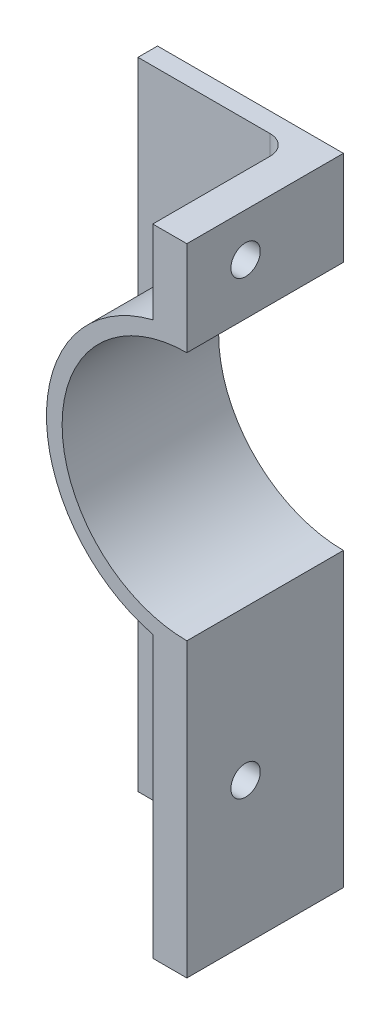
ISO-10303-21;
HEADER;
FILE_DESCRIPTION(('STEP AP214'),'2;1');
FILE_NAME('part.step','',(''),(''),'','','');
FILE_SCHEMA(('AUTOMOTIVE_DESIGN { 1 0 10303 214 1 1 1 1 }'));
ENDSEC;
DATA;
#1=APPLICATION_CONTEXT('core data for automotive mechanical design processes');
#2=APPLICATION_PROTOCOL_DEFINITION('international standard','automotive_design',2000,#1);
#3=PRODUCT_CONTEXT('',#1,'mechanical');
#4=PRODUCT('Part','Part','',(#3));
#5=PRODUCT_RELATED_PRODUCT_CATEGORY('part','',(#4));
#6=PRODUCT_DEFINITION_FORMATION('','',#4);
#7=PRODUCT_DEFINITION_CONTEXT('part definition',#1,'design');
#8=PRODUCT_DEFINITION('design','',#6,#7);
#9=PRODUCT_DEFINITION_SHAPE('','',#8);
#10=(LENGTH_UNIT() NAMED_UNIT(*) SI_UNIT(.MILLI.,.METRE.));
#11=(NAMED_UNIT(*) PLANE_ANGLE_UNIT() SI_UNIT($,.RADIAN.));
#12=(NAMED_UNIT(*) SI_UNIT($,.STERADIAN.) SOLID_ANGLE_UNIT());
#13=UNCERTAINTY_MEASURE_WITH_UNIT(LENGTH_MEASURE(1.E-05),#10,'distance_accuracy_value','');
#14=(GEOMETRIC_REPRESENTATION_CONTEXT(3) GLOBAL_UNCERTAINTY_ASSIGNED_CONTEXT((#13)) GLOBAL_UNIT_ASSIGNED_CONTEXT((#10,
#11,#12)) REPRESENTATION_CONTEXT('',''));
#15=CARTESIAN_POINT('',(0.,0.,0.));
#16=DIRECTION('',(0.,0.,1.));
#17=DIRECTION('',(1.,0.,0.));
#18=AXIS2_PLACEMENT_3D('',#15,#16,#17);
#19=CARTESIAN_POINT('',(19.7022423830163,0.,20.32));
#20=DIRECTION('',(1.,0.,0.));
#21=DIRECTION('',(0.,0.,-1.));
#22=AXIS2_PLACEMENT_3D('',#19,#20,#21);
#23=PLANE('',#22);
#24=CARTESIAN_POINT('',(19.7022423830163,76.9461103821239,12.7));
#25=DIRECTION('',(1.,0.,0.));
#26=DIRECTION('',(0.,0.,-1.));
#27=AXIS2_PLACEMENT_3D('',#24,#25,#26);
#28=CIRCLE('',#27,1.905);
#29=CARTESIAN_POINT('',(19.7022423830163,76.9461103821239,10.795));
#30=VERTEX_POINT('',#29);
#31=EDGE_CURVE('E346',#30,#30,#28,.F.);
#32=ORIENTED_EDGE('',*,*,#31,.F.);
#33=EDGE_LOOP('',(#32));
#34=FACE_BOUND('',#33,.T.);
#35=DIRECTION('',(0.,0.,-1.));
#36=VECTOR('',#35,1.);
#37=CARTESIAN_POINT('',(19.7022423830163,82.55,20.32));
#38=LINE('',#37,#36);
#39=CARTESIAN_POINT('',(19.7022423830163,82.55,20.32));
#40=VERTEX_POINT('',#39);
#41=CARTESIAN_POINT('',(19.7022423830163,82.55,5.08));
#42=VERTEX_POINT('',#41);
#43=EDGE_CURVE('E211',#40,#42,#38,.T.);
#44=ORIENTED_EDGE('',*,*,#43,.T.);
#45=DIRECTION('',(0.,-1.,0.));
#46=VECTOR('',#45,1.);
#47=CARTESIAN_POINT('',(19.7022423830163,0.,5.08));
#48=LINE('',#47,#46);
#49=CARTESIAN_POINT('',(19.7022423830163,71.7804434477485,5.08));
#50=VERTEX_POINT('',#49);
#51=EDGE_CURVE('E249',#42,#50,#48,.T.);
#52=ORIENTED_EDGE('',*,*,#51,.T.);
#53=DIRECTION('',(0.,0.,-1.));
#54=VECTOR('',#53,1.);
#55=CARTESIAN_POINT('',(19.7022423830163,71.7804434477485,20.32));
#56=LINE('',#55,#54);
#57=CARTESIAN_POINT('',(19.7022423830163,71.7804434477485,20.32));
#58=VERTEX_POINT('',#57);
#59=EDGE_CURVE('E246',#58,#50,#56,.T.);
#60=ORIENTED_EDGE('',*,*,#59,.F.);
#61=DIRECTION('',(0.,-1.,0.));
#62=VECTOR('',#61,1.);
#63=CARTESIAN_POINT('',(19.7022423830163,0.,20.32));
#64=LINE('',#63,#62);
#65=EDGE_CURVE('E183',#40,#58,#64,.T.);
#66=ORIENTED_EDGE('',*,*,#65,.F.);
#67=EDGE_LOOP('',(#44,#52,#60,#66));
#68=FACE_BOUND('',#67,.T.);
#69=ADVANCED_FACE('F45',(#34,#68),#23,.F.);
#70=CARTESIAN_POINT('',(24.13,54.102,20.32));
#71=DIRECTION('',(0.,0.,-1.));
#72=DIRECTION('',(-1.,0.,0.));
#73=AXIS2_PLACEMENT_3D('',#70,#71,#72);
#74=CYLINDRICAL_SURFACE('',#73,18.2245);
#75=ORIENTED_EDGE('',*,*,#59,.T.);
#76=CARTESIAN_POINT('',(24.13,54.102,5.08));
#77=DIRECTION('',(0.,0.,1.));
#78=DIRECTION('',(1.,0.,0.));
#79=AXIS2_PLACEMENT_3D('',#76,#77,#78);
#80=CIRCLE('',#79,18.2245);
#81=CARTESIAN_POINT('',(19.7022423830163,36.4235565522515,5.08));
#82=VERTEX_POINT('',#81);
#83=EDGE_CURVE('E76',#50,#82,#80,.T.);
#84=ORIENTED_EDGE('',*,*,#83,.T.);
#85=DIRECTION('',(0.,0.,-1.));
#86=VECTOR('',#85,1.);
#87=CARTESIAN_POINT('',(19.7022423830163,36.4235565522515,20.32));
#88=LINE('',#87,#86);
#89=CARTESIAN_POINT('',(19.7022423830163,36.4235565522515,20.32));
#90=VERTEX_POINT('',#89);
#91=EDGE_CURVE('E243',#90,#82,#88,.T.);
#92=ORIENTED_EDGE('',*,*,#91,.F.);
#93=CARTESIAN_POINT('',(24.13,54.102,20.32));
#94=DIRECTION('',(0.,0.,1.));
#95=DIRECTION('',(1.,0.,0.));
#96=AXIS2_PLACEMENT_3D('',#93,#94,#95);
#97=CIRCLE('',#96,18.2245);
#98=EDGE_CURVE('E187',#58,#90,#97,.T.);
#99=ORIENTED_EDGE('',*,*,#98,.F.);
#100=EDGE_LOOP('',(#75,#84,#92,#99));
#101=FACE_BOUND('',#100,.T.);
#102=ADVANCED_FACE('F290',(#101),#74,.T.);
#103=CARTESIAN_POINT('',(19.7022423830163,0.,20.32));
#104=DIRECTION('',(-1.,0.,0.));
#105=DIRECTION('',(0.,0.,1.));
#106=AXIS2_PLACEMENT_3D('',#103,#104,#105);
#107=PLANE('',#106);
#108=CARTESIAN_POINT('',(19.7022423830163,18.4308896178761,12.7));
#109=DIRECTION('',(-1.,0.,0.));
#110=DIRECTION('',(0.,0.,1.));
#111=AXIS2_PLACEMENT_3D('',#108,#109,#110);
#112=CIRCLE('',#111,1.905);
#113=CARTESIAN_POINT('',(19.7022423830163,18.4308896178761,14.605));
#114=VERTEX_POINT('',#113);
#115=EDGE_CURVE('E180',#114,#114,#112,.F.);
#116=ORIENTED_EDGE('',*,*,#115,.T.);
#117=EDGE_LOOP('',(#116));
#118=FACE_BOUND('',#117,.T.);
#119=ORIENTED_EDGE('',*,*,#91,.T.);
#120=DIRECTION('',(0.,1.,0.));
#121=VECTOR('',#120,1.);
#122=CARTESIAN_POINT('',(19.7022423830163,0.,5.08));
#123=LINE('',#122,#121);
#124=CARTESIAN_POINT('',(19.7022423830163,0.,5.08));
#125=VERTEX_POINT('',#124);
#126=EDGE_CURVE('E68',#82,#125,#123,.F.);
#127=ORIENTED_EDGE('',*,*,#126,.T.);
#128=DIRECTION('',(0.,0.,-1.));
#129=VECTOR('',#128,1.);
#130=CARTESIAN_POINT('',(19.7022423830163,0.,20.32));
#131=LINE('',#130,#129);
#132=CARTESIAN_POINT('',(19.7022423830163,0.,20.32));
#133=VERTEX_POINT('',#132);
#134=EDGE_CURVE('E240',#133,#125,#131,.T.);
#135=ORIENTED_EDGE('',*,*,#134,.F.);
#136=DIRECTION('',(0.,1.,0.));
#137=VECTOR('',#136,1.);
#138=CARTESIAN_POINT('',(19.7022423830163,0.,20.32));
#139=LINE('',#138,#137);
#140=EDGE_CURVE('E190',#133,#90,#139,.T.);
#141=ORIENTED_EDGE('',*,*,#140,.T.);
#142=EDGE_LOOP('',(#119,#127,#135,#141));
#143=FACE_BOUND('',#142,.T.);
#144=ADVANCED_FACE('F295',(#118,#143),#107,.T.);
#145=CARTESIAN_POINT('',(0.,0.,20.32));
#146=DIRECTION('',(0.,-1.,0.));
#147=DIRECTION('',(0.,0.,-1.));
#148=AXIS2_PLACEMENT_3D('',#145,#146,#147);
#149=PLANE('',#148);
#150=DIRECTION('',(-1.,0.,0.));
#151=VECTOR('',#150,1.);
#152=CARTESIAN_POINT('',(0.,0.,0.));
#153=LINE('',#152,#151);
#154=CARTESIAN_POINT('',(24.13,0.,0.));
#155=VERTEX_POINT('',#154);
#156=CARTESIAN_POINT('',(0.,0.,0.));
#157=VERTEX_POINT('',#156);
#158=EDGE_CURVE('E155',#155,#157,#153,.T.);
#159=ORIENTED_EDGE('',*,*,#158,.F.);
#160=DIRECTION('',(0.,0.,-1.));
#161=VECTOR('',#160,1.);
#162=CARTESIAN_POINT('',(24.13,0.,20.32));
#163=LINE('',#162,#161);
#164=CARTESIAN_POINT('',(24.13,0.,20.32));
#165=VERTEX_POINT('',#164);
#166=EDGE_CURVE('E237',#165,#155,#163,.T.);
#167=ORIENTED_EDGE('',*,*,#166,.F.);
#168=DIRECTION('',(-1.,0.,0.));
#169=VECTOR('',#168,1.);
#170=CARTESIAN_POINT('',(0.,0.,20.32));
#171=LINE('',#170,#169);
#172=EDGE_CURVE('E194',#165,#133,#171,.T.);
#173=ORIENTED_EDGE('',*,*,#172,.T.);
#174=ORIENTED_EDGE('',*,*,#134,.T.);
#175=CARTESIAN_POINT('',(17.1622423830163,0.,5.08));
#176=DIRECTION('',(0.,-1.,0.));
#177=DIRECTION('',(0.,0.,-1.));
#178=AXIS2_PLACEMENT_3D('',#175,#176,#177);
#179=CIRCLE('',#178,2.54);
#180=CARTESIAN_POINT('',(17.1622423830163,0.,2.54));
#181=VERTEX_POINT('',#180);
#182=EDGE_CURVE('E11',#125,#181,#179,.F.);
#183=ORIENTED_EDGE('',*,*,#182,.T.);
#184=DIRECTION('',(-1.,0.,0.));
#185=VECTOR('',#184,1.);
#186=CARTESIAN_POINT('',(0.,0.,2.54));
#187=LINE('',#186,#185);
#188=CARTESIAN_POINT('',(0.,0.,2.54));
#189=VERTEX_POINT('',#188);
#190=EDGE_CURVE('E172',#181,#189,#187,.T.);
#191=ORIENTED_EDGE('',*,*,#190,.T.);
#192=DIRECTION('',(0.,0.,-1.));
#193=VECTOR('',#192,1.);
#194=CARTESIAN_POINT('',(0.,0.,2.54));
#195=LINE('',#194,#193);
#196=EDGE_CURVE('E156',#189,#157,#195,.T.);
#197=ORIENTED_EDGE('',*,*,#196,.T.);
#198=EDGE_LOOP('',(#159,#167,#173,#174,#183,#191,#197));
#199=FACE_BOUND('',#198,.T.);
#200=ADVANCED_FACE('F302',(#199),#149,.T.);
#201=CARTESIAN_POINT('',(24.13,0.,20.32));
#202=DIRECTION('',(1.,0.,0.));
#203=DIRECTION('',(0.,0.,-1.));
#204=AXIS2_PLACEMENT_3D('',#201,#202,#203);
#205=PLANE('',#204);
#206=CARTESIAN_POINT('',(24.13,18.4308896178761,12.7));
#207=DIRECTION('',(1.,0.,0.));
#208=DIRECTION('',(0.,0.,-1.));
#209=AXIS2_PLACEMENT_3D('',#206,#207,#208);
#210=CIRCLE('',#209,1.905);
#211=CARTESIAN_POINT('',(24.13,18.4308896178761,10.795));
#212=VERTEX_POINT('',#211);
#213=EDGE_CURVE('E343',#212,#212,#210,.T.);
#214=ORIENTED_EDGE('',*,*,#213,.F.);
#215=EDGE_LOOP('',(#214));
#216=FACE_BOUND('',#215,.T.);
#217=DIRECTION('',(0.,-1.,0.));
#218=VECTOR('',#217,1.);
#219=CARTESIAN_POINT('',(24.13,0.,0.));
#220=LINE('',#219,#218);
#221=CARTESIAN_POINT('',(24.13,37.9095,0.));
#222=VERTEX_POINT('',#221);
#223=EDGE_CURVE('E214',#222,#155,#220,.T.);
#224=ORIENTED_EDGE('',*,*,#223,.F.);
#225=DIRECTION('',(0.,0.,-1.));
#226=VECTOR('',#225,1.);
#227=CARTESIAN_POINT('',(24.13,37.9095,20.32));
#228=LINE('',#227,#226);
#229=CARTESIAN_POINT('',(24.13,37.9095,20.32));
#230=VERTEX_POINT('',#229);
#231=EDGE_CURVE('E234',#230,#222,#228,.T.);
#232=ORIENTED_EDGE('',*,*,#231,.F.);
#233=DIRECTION('',(0.,-1.,0.));
#234=VECTOR('',#233,1.);
#235=CARTESIAN_POINT('',(24.13,0.,20.32));
#236=LINE('',#235,#234);
#237=EDGE_CURVE('E198',#230,#165,#236,.T.);
#238=ORIENTED_EDGE('',*,*,#237,.T.);
#239=ORIENTED_EDGE('',*,*,#166,.T.);
#240=EDGE_LOOP('',(#224,#232,#238,#239));
#241=FACE_BOUND('',#240,.T.);
#242=ADVANCED_FACE('F306',(#216,#241),#205,.T.);
#243=CARTESIAN_POINT('',(24.13,54.102,20.32));
#244=DIRECTION('',(0.,0.,-1.));
#245=DIRECTION('',(-1.,0.,0.));
#246=AXIS2_PLACEMENT_3D('',#243,#244,#245);
#247=CYLINDRICAL_SURFACE('',#246,16.1925);
#248=CARTESIAN_POINT('',(24.13,54.102,0.));
#249=DIRECTION('',(0.,0.,1.));
#250=DIRECTION('',(1.,0.,0.));
#251=AXIS2_PLACEMENT_3D('',#248,#249,#250);
#252=CIRCLE('',#251,16.1925);
#253=CARTESIAN_POINT('',(24.13,70.2945,0.));
#254=VERTEX_POINT('',#253);
#255=EDGE_CURVE('E218',#254,#222,#252,.T.);
#256=ORIENTED_EDGE('',*,*,#255,.F.);
#257=DIRECTION('',(0.,0.,-1.));
#258=VECTOR('',#257,1.);
#259=CARTESIAN_POINT('',(24.13,70.2945,20.32));
#260=LINE('',#259,#258);
#261=CARTESIAN_POINT('',(24.13,70.2945,20.32));
#262=VERTEX_POINT('',#261);
#263=EDGE_CURVE('E231',#262,#254,#260,.T.);
#264=ORIENTED_EDGE('',*,*,#263,.F.);
#265=CARTESIAN_POINT('',(24.13,54.102,20.32));
#266=DIRECTION('',(0.,0.,1.));
#267=DIRECTION('',(1.,0.,0.));
#268=AXIS2_PLACEMENT_3D('',#265,#266,#267);
#269=CIRCLE('',#268,16.1925);
#270=EDGE_CURVE('E202',#262,#230,#269,.T.);
#271=ORIENTED_EDGE('',*,*,#270,.T.);
#272=ORIENTED_EDGE('',*,*,#231,.T.);
#273=EDGE_LOOP('',(#256,#264,#271,#272));
#274=FACE_BOUND('',#273,.T.);
#275=ADVANCED_FACE('F308',(#274),#247,.F.);
#276=CARTESIAN_POINT('',(24.13,76.9461103821239,12.7));
#277=DIRECTION('',(1.,0.,0.));
#278=DIRECTION('',(0.,0.,-1.));
#279=AXIS2_PLACEMENT_3D('',#276,#277,#278);
#280=CIRCLE('',#279,1.905);
#281=CARTESIAN_POINT('',(24.13,76.9461103821239,10.795));
#282=VERTEX_POINT('',#281);
#283=EDGE_CURVE('E347',#282,#282,#280,.T.);
#284=ORIENTED_EDGE('',*,*,#283,.F.);
#285=EDGE_LOOP('',(#284));
#286=FACE_BOUND('',#285,.T.);
#287=CARTESIAN_POINT('',(24.13,82.55,0.));
#288=VERTEX_POINT('',#287);
#289=EDGE_CURVE('E219',#288,#254,#220,.T.);
#290=ORIENTED_EDGE('',*,*,#289,.F.);
#291=DIRECTION('',(0.,0.,-1.));
#292=VECTOR('',#291,1.);
#293=CARTESIAN_POINT('',(24.13,82.55,20.32));
#294=LINE('',#293,#292);
#295=CARTESIAN_POINT('',(24.13,82.55,20.32));
#296=VERTEX_POINT('',#295);
#297=EDGE_CURVE('E228',#296,#288,#294,.T.);
#298=ORIENTED_EDGE('',*,*,#297,.F.);
#299=EDGE_CURVE('E203',#296,#262,#236,.T.);
#300=ORIENTED_EDGE('',*,*,#299,.T.);
#301=ORIENTED_EDGE('',*,*,#263,.T.);
#302=EDGE_LOOP('',(#290,#298,#300,#301));
#303=FACE_BOUND('',#302,.T.);
#304=ADVANCED_FACE('F311',(#286,#303),#205,.T.);
#305=CARTESIAN_POINT('',(0.,82.55,20.32));
#306=DIRECTION('',(0.,1.,0.));
#307=DIRECTION('',(0.,0.,1.));
#308=AXIS2_PLACEMENT_3D('',#305,#306,#307);
#309=PLANE('',#308);
#310=DIRECTION('',(1.,0.,0.));
#311=VECTOR('',#310,1.);
#312=CARTESIAN_POINT('',(0.,82.55,0.));
#313=LINE('',#312,#311);
#314=CARTESIAN_POINT('',(0.,82.55,0.));
#315=VERTEX_POINT('',#314);
#316=EDGE_CURVE('E149',#315,#288,#313,.T.);
#317=ORIENTED_EDGE('',*,*,#316,.F.);
#318=DIRECTION('',(0.,0.,-1.));
#319=VECTOR('',#318,1.);
#320=CARTESIAN_POINT('',(0.,82.55,2.54));
#321=LINE('',#320,#319);
#322=CARTESIAN_POINT('',(0.,82.55,2.54));
#323=VERTEX_POINT('',#322);
#324=EDGE_CURVE('E143',#323,#315,#321,.T.);
#325=ORIENTED_EDGE('',*,*,#324,.F.);
#326=DIRECTION('',(1.,0.,0.));
#327=VECTOR('',#326,1.);
#328=CARTESIAN_POINT('',(0.,82.55,2.54));
#329=LINE('',#328,#327);
#330=CARTESIAN_POINT('',(17.1622423830163,82.55,2.54));
#331=VERTEX_POINT('',#330);
#332=EDGE_CURVE('E146',#323,#331,#329,.T.);
#333=ORIENTED_EDGE('',*,*,#332,.T.);
#334=CARTESIAN_POINT('',(17.1622423830163,82.55,5.08));
#335=DIRECTION('',(0.,1.,0.));
#336=DIRECTION('',(0.,0.,1.));
#337=AXIS2_PLACEMENT_3D('',#334,#335,#336);
#338=CIRCLE('',#337,2.54);
#339=EDGE_CURVE('E60',#331,#42,#338,.F.);
#340=ORIENTED_EDGE('',*,*,#339,.T.);
#341=ORIENTED_EDGE('',*,*,#43,.F.);
#342=DIRECTION('',(1.,0.,0.));
#343=VECTOR('',#342,1.);
#344=CARTESIAN_POINT('',(0.,82.55,20.32));
#345=LINE('',#344,#343);
#346=EDGE_CURVE('E207',#40,#296,#345,.T.);
#347=ORIENTED_EDGE('',*,*,#346,.T.);
#348=ORIENTED_EDGE('',*,*,#297,.T.);
#349=EDGE_LOOP('',(#317,#325,#333,#340,#341,#347,#348));
#350=FACE_BOUND('',#349,.T.);
#351=ADVANCED_FACE('F145',(#350),#309,.T.);
#352=CARTESIAN_POINT('',(0.,0.,20.32));
#353=DIRECTION('',(0.,0.,1.));
#354=DIRECTION('',(1.,0.,0.));
#355=AXIS2_PLACEMENT_3D('',#352,#353,#354);
#356=PLANE('',#355);
#357=ORIENTED_EDGE('',*,*,#65,.T.);
#358=ORIENTED_EDGE('',*,*,#98,.T.);
#359=ORIENTED_EDGE('',*,*,#140,.F.);
#360=ORIENTED_EDGE('',*,*,#172,.F.);
#361=ORIENTED_EDGE('',*,*,#237,.F.);
#362=ORIENTED_EDGE('',*,*,#270,.F.);
#363=ORIENTED_EDGE('',*,*,#299,.F.);
#364=ORIENTED_EDGE('',*,*,#346,.F.);
#365=EDGE_LOOP('',(#357,#358,#359,#360,#361,#362,#363,#364));
#366=FACE_BOUND('',#365,.T.);
#367=ADVANCED_FACE('F318',(#366),#356,.T.);
#368=CARTESIAN_POINT('',(0.,0.,0.));
#369=DIRECTION('',(0.,0.,1.));
#370=DIRECTION('',(1.,0.,0.));
#371=AXIS2_PLACEMENT_3D('',#368,#369,#370);
#372=PLANE('',#371);
#373=DIRECTION('',(0.,1.,0.));
#374=VECTOR('',#373,1.);
#375=CARTESIAN_POINT('',(0.,0.,0.));
#376=LINE('',#375,#374);
#377=EDGE_CURVE('E166',#157,#315,#376,.T.);
#378=ORIENTED_EDGE('',*,*,#377,.T.);
#379=ORIENTED_EDGE('',*,*,#316,.T.);
#380=ORIENTED_EDGE('',*,*,#289,.T.);
#381=ORIENTED_EDGE('',*,*,#255,.T.);
#382=ORIENTED_EDGE('',*,*,#223,.T.);
#383=ORIENTED_EDGE('',*,*,#158,.T.);
#384=EDGE_LOOP('',(#378,#379,#380,#381,#382,#383));
#385=FACE_BOUND('',#384,.T.);
#386=ADVANCED_FACE('F319',(#385),#372,.F.);
#387=CARTESIAN_POINT('',(0.,0.,2.54));
#388=DIRECTION('',(-1.,0.,0.));
#389=DIRECTION('',(0.,0.,1.));
#390=AXIS2_PLACEMENT_3D('',#387,#388,#389);
#391=PLANE('',#390);
#392=ORIENTED_EDGE('',*,*,#377,.F.);
#393=ORIENTED_EDGE('',*,*,#196,.F.);
#394=DIRECTION('',(0.,1.,0.));
#395=VECTOR('',#394,1.);
#396=CARTESIAN_POINT('',(0.,0.,2.54));
#397=LINE('',#396,#395);
#398=EDGE_CURVE('E162',#189,#323,#397,.T.);
#399=ORIENTED_EDGE('',*,*,#398,.T.);
#400=ORIENTED_EDGE('',*,*,#324,.T.);
#401=EDGE_LOOP('',(#392,#393,#399,#400));
#402=FACE_BOUND('',#401,.T.);
#403=ADVANCED_FACE('F169',(#402),#391,.T.);
#404=CARTESIAN_POINT('',(0.,0.,2.54));
#405=DIRECTION('',(0.,0.,1.));
#406=DIRECTION('',(1.,0.,0.));
#407=AXIS2_PLACEMENT_3D('',#404,#405,#406);
#408=PLANE('',#407);
#409=CARTESIAN_POINT('',(24.13,54.102,2.54));
#410=DIRECTION('',(0.,0.,1.));
#411=DIRECTION('',(1.,0.,0.));
#412=AXIS2_PLACEMENT_3D('',#409,#410,#411);
#413=CIRCLE('',#412,20.7645);
#414=CARTESIAN_POINT('',(17.1622423830163,34.5414577263061,2.54));
#415=VERTEX_POINT('',#414);
#416=CARTESIAN_POINT('',(17.1622423830163,73.6625422736939,2.54));
#417=VERTEX_POINT('',#416);
#418=EDGE_CURVE('E256',#415,#417,#413,.F.);
#419=ORIENTED_EDGE('',*,*,#418,.T.);
#420=DIRECTION('',(0.,-1.,0.));
#421=VECTOR('',#420,1.);
#422=CARTESIAN_POINT('',(17.1622423830163,0.,2.54));
#423=LINE('',#422,#421);
#424=EDGE_CURVE('E164',#417,#331,#423,.F.);
#425=ORIENTED_EDGE('',*,*,#424,.T.);
#426=ORIENTED_EDGE('',*,*,#332,.F.);
#427=ORIENTED_EDGE('',*,*,#398,.F.);
#428=ORIENTED_EDGE('',*,*,#190,.F.);
#429=DIRECTION('',(0.,1.,0.));
#430=VECTOR('',#429,1.);
#431=CARTESIAN_POINT('',(17.1622423830163,36.4235565522515,2.54));
#432=LINE('',#431,#430);
#433=EDGE_CURVE('E253',#181,#415,#432,.T.);
#434=ORIENTED_EDGE('',*,*,#433,.T.);
#435=EDGE_LOOP('',(#419,#425,#426,#427,#428,#434));
#436=FACE_BOUND('',#435,.T.);
#437=ADVANCED_FACE('F160',(#436),#408,.T.);
#438=CARTESIAN_POINT('',(24.13,76.9461103821239,12.7));
#439=DIRECTION('',(-1.,0.,0.));
#440=DIRECTION('',(0.,0.,1.));
#441=AXIS2_PLACEMENT_3D('',#438,#439,#440);
#442=CYLINDRICAL_SURFACE('',#441,1.905);
#443=ORIENTED_EDGE('',*,*,#283,.T.);
#444=EDGE_LOOP('',(#443));
#445=FACE_BOUND('',#444,.T.);
#446=ORIENTED_EDGE('',*,*,#31,.T.);
#447=EDGE_LOOP('',(#446));
#448=FACE_BOUND('',#447,.T.);
#449=ADVANCED_FACE('F330',(#445,#448),#442,.F.);
#450=CARTESIAN_POINT('',(24.13,18.4308896178761,12.7));
#451=DIRECTION('',(-1.,0.,0.));
#452=DIRECTION('',(0.,0.,1.));
#453=AXIS2_PLACEMENT_3D('',#450,#451,#452);
#454=CYLINDRICAL_SURFACE('',#453,1.905);
#455=ORIENTED_EDGE('',*,*,#115,.F.);
#456=EDGE_LOOP('',(#455));
#457=FACE_BOUND('',#456,.T.);
#458=ORIENTED_EDGE('',*,*,#213,.T.);
#459=EDGE_LOOP('',(#458));
#460=FACE_BOUND('',#459,.T.);
#461=ADVANCED_FACE('F286',(#457,#460),#454,.F.);
#462=CARTESIAN_POINT('',(17.1622423830163,0.,5.08));
#463=DIRECTION('',(0.,-1.,0.));
#464=DIRECTION('',(0.,0.,-1.));
#465=AXIS2_PLACEMENT_3D('',#462,#463,#464);
#466=CYLINDRICAL_SURFACE('',#465,2.54);
#467=ORIENTED_EDGE('',*,*,#182,.F.);
#468=ORIENTED_EDGE('',*,*,#126,.F.);
#469=CARTESIAN_POINT('',(19.7022423830163,36.4235565522515,5.08));
#470=CARTESIAN_POINT('',(19.7022552822327,36.4235676405756,5.01897538217353));
#471=CARTESIAN_POINT('',(19.7000435809073,36.4218405688876,4.95795962402907));
#472=CARTESIAN_POINT('',(19.6912701428922,36.4149949865072,4.83646639805687));
#473=CARTESIAN_POINT('',(19.6847108418805,36.4098783747551,4.77598864803288));
#474=CARTESIAN_POINT('',(19.6673963794047,36.3963814580596,4.65640393504167));
#475=CARTESIAN_POINT('',(19.6566681575988,36.3880221083523,4.59729070176332));
#476=CARTESIAN_POINT('',(19.6312001854687,36.3681971723338,4.48047851498156));
#477=CARTESIAN_POINT('',(19.6164600689664,36.3567313024812,4.4227796911));
#478=CARTESIAN_POINT('',(19.5666031526076,36.3179961998343,4.25261593225715));
#479=CARTESIAN_POINT('',(19.5257983766509,36.2863492163571,4.14273999892197));
#480=CARTESIAN_POINT('',(19.431105221785,36.2131678833309,3.93229095749426));
#481=CARTESIAN_POINT('',(19.3771973920554,36.1716188364754,3.83173198935096));
#482=CARTESIAN_POINT('',(19.2538425204785,36.0769429075849,3.63381837993295));
#483=CARTESIAN_POINT('',(19.183509032085,36.0231640499139,3.53733176574616));
#484=CARTESIAN_POINT('',(19.0326979045918,35.908437306874,3.35756508763328));
#485=CARTESIAN_POINT('',(18.9522182280419,35.8474879817724,3.27428768384699));
#486=CARTESIAN_POINT('',(18.7659923493545,35.7072285995142,3.10555862836759));
#487=CARTESIAN_POINT('',(18.6584371643441,35.6267061051229,3.02311284318054));
#488=CARTESIAN_POINT('',(18.4346055120523,35.4603040496386,2.87760468717861));
#489=CARTESIAN_POINT('',(18.3183183951034,35.3744179691951,2.81456648008226));
#490=CARTESIAN_POINT('',(18.0560072020111,35.1820715686115,2.69729218533377));
#491=CARTESIAN_POINT('',(17.9086388409062,35.0748920261983,2.64723846659538));
#492=CARTESIAN_POINT('',(17.6088601537767,34.8587484731646,2.57483512814307));
#493=CARTESIAN_POINT('',(17.4564589922287,34.7497878707695,2.55243772608442));
#494=CARTESIAN_POINT('',(17.2591496890661,34.6099043790823,2.54146439184898));
#495=CARTESIAN_POINT('',(17.2149587681032,34.5786509118086,2.54016191801443));
#496=CARTESIAN_POINT('',(17.1678999909345,34.545448543402,2.54000472801651));
#497=CARTESIAN_POINT('',(17.1650712639691,34.5434530369532,2.5400000023258));
#498=CARTESIAN_POINT('',(17.1622423830163,34.5414577263061,2.54));
#499=B_SPLINE_CURVE_WITH_KNOTS('',3,(#469,#470,#471,#472,#473,#474,#475,#476,#477,#478,#479,
#480,#481,#482,#483,#484,#485,#486,#487,#488,#489,#490,#491,#492,#493,#494,#495,#496,#497,#498),
.UNSPECIFIED.,.F.,.F.,(4,2,2,2,2,2,2,2,2,2,2,2,2,2,4),(0.,0.182994816607481,0.365887199646657,
0.547616871590237,0.729363136136366,1.09181975379095,1.4548177416821,1.84625019823647,
2.23776138369367,2.70894042088298,3.18070375654704,3.74543113503546,4.30918145189486,
4.47157553584164,4.48196080013805),.UNSPECIFIED.);
#500=EDGE_CURVE('E50',#415,#82,#499,.F.);
#501=ORIENTED_EDGE('',*,*,#500,.F.);
#502=ORIENTED_EDGE('',*,*,#433,.F.);
#503=EDGE_LOOP('',(#467,#468,#501,#502));
#504=FACE_BOUND('',#503,.T.);
#505=ADVANCED_FACE('F47',(#504),#466,.F.);
#506=CARTESIAN_POINT('',(24.13,54.102,5.08));
#507=DIRECTION('',(0.,0.,1.));
#508=DIRECTION('',(1.,0.,0.));
#509=AXIS2_PLACEMENT_3D('',#506,#507,#508);
#510=TOROIDAL_SURFACE('',#509,20.7645,2.54);
#511=ORIENTED_EDGE('',*,*,#500,.T.);
#512=ORIENTED_EDGE('',*,*,#83,.F.);
#513=CARTESIAN_POINT('',(19.7022423830163,71.7804434477485,5.08));
#514=CARTESIAN_POINT('',(19.7022552822327,71.7804323594244,5.01897538217353));
#515=CARTESIAN_POINT('',(19.7000435809073,71.7821594311123,4.95795962402907));
#516=CARTESIAN_POINT('',(19.6912701428922,71.7890050134928,4.83646639805687));
#517=CARTESIAN_POINT('',(19.6847108418805,71.7941216252449,4.77598864803288));
#518=CARTESIAN_POINT('',(19.6673963794047,71.8076185419404,4.65640393504167));
#519=CARTESIAN_POINT('',(19.6566681575988,71.8159778916477,4.59729070176332));
#520=CARTESIAN_POINT('',(19.6312001854687,71.8358028276662,4.48047851498156));
#521=CARTESIAN_POINT('',(19.6164600689664,71.8472686975188,4.4227796911));
#522=CARTESIAN_POINT('',(19.5666031526076,71.8860038001657,4.25261593225715));
#523=CARTESIAN_POINT('',(19.5257983766509,71.9176507836429,4.14273999892197));
#524=CARTESIAN_POINT('',(19.431105221785,71.990832116669,3.93229095749426));
#525=CARTESIAN_POINT('',(19.3771973920554,72.0323811635246,3.83173198935096));
#526=CARTESIAN_POINT('',(19.2538425204785,72.1270570924151,3.63381837993295));
#527=CARTESIAN_POINT('',(19.183509032085,72.1808359500861,3.53733176574616));
#528=CARTESIAN_POINT('',(19.0326979045918,72.295562693126,3.35756508763328));
#529=CARTESIAN_POINT('',(18.9522182280419,72.3565120182276,3.27428768384699));
#530=CARTESIAN_POINT('',(18.7659923493545,72.4967714004857,3.1055586283676));
#531=CARTESIAN_POINT('',(18.6584371643441,72.5772938948771,3.02311284318055));
#532=CARTESIAN_POINT('',(18.4346055120524,72.7436959503615,2.87760468717861));
#533=CARTESIAN_POINT('',(18.3183183951035,72.829582030805,2.81456648008226));
#534=CARTESIAN_POINT('',(18.056007202011,73.0219284313884,2.69729218533377));
#535=CARTESIAN_POINT('',(17.9086388409059,73.1291079738013,2.64723846659538));
#536=CARTESIAN_POINT('',(17.608860153777,73.3452515268358,2.57483512814307));
#537=CARTESIAN_POINT('',(17.4564589922297,73.454212129232,2.55243772608442));
#538=CARTESIAN_POINT('',(17.2591496890658,73.5940956209172,2.54146439184899));
#539=CARTESIAN_POINT('',(17.2149587681024,73.6253490881902,2.54016191801443));
#540=CARTESIAN_POINT('',(17.1678999909344,73.6585514565978,2.54000472801651));
#541=CARTESIAN_POINT('',(17.165071263969,73.6605469630467,2.5400000023258));
#542=CARTESIAN_POINT('',(17.1622423830163,73.6625422736939,2.54));
#543=B_SPLINE_CURVE_WITH_KNOTS('',3,(#513,#514,#515,#516,#517,#518,#519,#520,#521,#522,#523,
#524,#525,#526,#527,#528,#529,#530,#531,#532,#533,#534,#535,#536,#537,#538,#539,#540,#541,#542),
.UNSPECIFIED.,.F.,.F.,(4,2,2,2,2,2,2,2,2,2,2,2,2,2,4),(0.,0.182994816607482,0.365887199646658,
0.547616871590239,0.729363136136367,1.09181975379094,1.4548177416821,1.84625019823647,
2.23776138369366,2.70894042088297,3.18070375654705,3.74543113503548,4.30918145189486,
4.47157553584163,4.48196080013804),.UNSPECIFIED.);
#544=EDGE_CURVE('E266',#417,#50,#543,.F.);
#545=ORIENTED_EDGE('',*,*,#544,.F.);
#546=ORIENTED_EDGE('',*,*,#418,.F.);
#547=EDGE_LOOP('',(#511,#512,#545,#546));
#548=FACE_BOUND('',#547,.T.);
#549=ADVANCED_FACE('F276',(#548),#510,.F.);
#550=CARTESIAN_POINT('',(17.1622423830163,0.,5.08));
#551=DIRECTION('',(0.,-1.,0.));
#552=DIRECTION('',(0.,0.,-1.));
#553=AXIS2_PLACEMENT_3D('',#550,#551,#552);
#554=CYLINDRICAL_SURFACE('',#553,2.54);
#555=ORIENTED_EDGE('',*,*,#339,.F.);
#556=ORIENTED_EDGE('',*,*,#424,.F.);
#557=ORIENTED_EDGE('',*,*,#544,.T.);
#558=ORIENTED_EDGE('',*,*,#51,.F.);
#559=EDGE_LOOP('',(#555,#556,#557,#558));
#560=FACE_BOUND('',#559,.T.);
#561=ADVANCED_FACE('F273',(#560),#554,.F.);
#562=CLOSED_SHELL('',(#69,#102,#144,#200,#242,#275,#304,#351,#367,#386,#403,#437,#449,#461,#505,
#549,#561));
#563=MANIFOLD_SOLID_BREP('B2',#562);
#564=ADVANCED_BREP_SHAPE_REPRESENTATION('',(#18,#563),#14);
#565=SHAPE_DEFINITION_REPRESENTATION(#9,#564);
ENDSEC;
END-ISO-10303-21;
